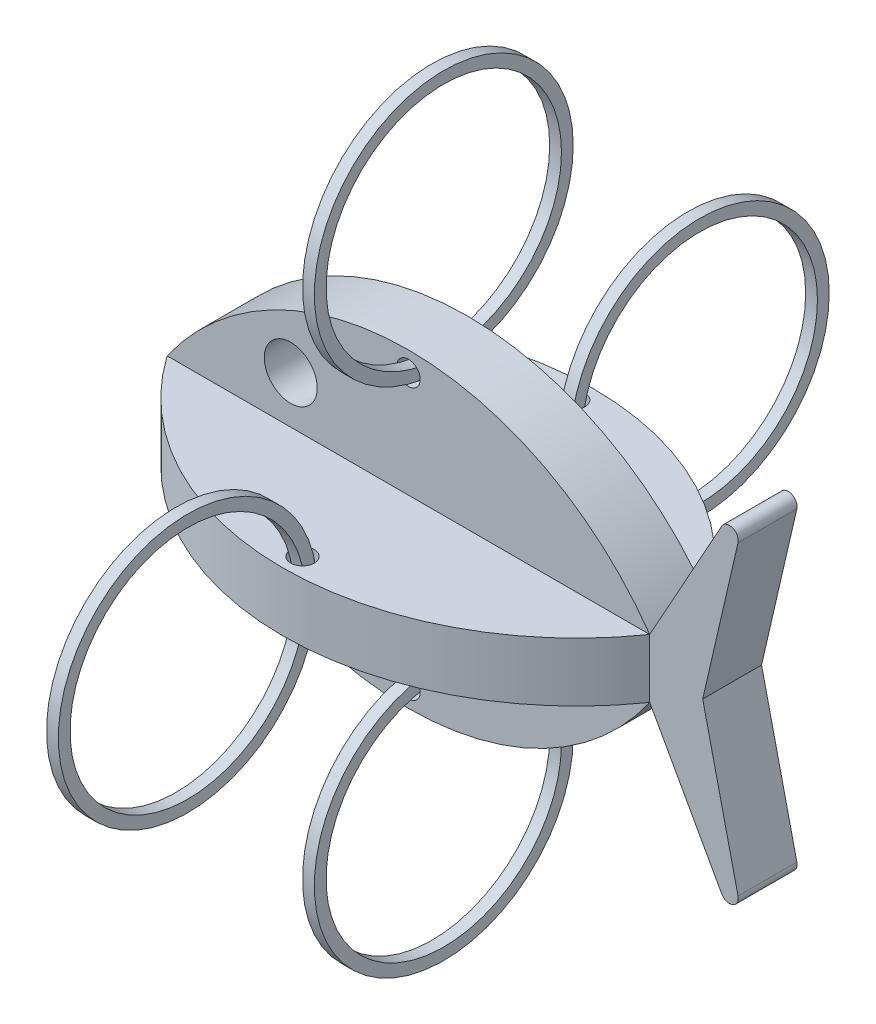
ISO-10303-21;
HEADER;
FILE_DESCRIPTION(('STEP AP214'),'2;1');
FILE_NAME('part.step','',(''),(''),'','','');
FILE_SCHEMA(('AUTOMOTIVE_DESIGN { 1 0 10303 214 1 1 1 1 }'));
ENDSEC;
DATA;
#1=APPLICATION_CONTEXT('core data for automotive mechanical design processes');
#2=APPLICATION_PROTOCOL_DEFINITION('international standard','automotive_design',2000,#1);
#3=PRODUCT_CONTEXT('',#1,'mechanical');
#4=PRODUCT('Part','Part','',(#3));
#5=PRODUCT_RELATED_PRODUCT_CATEGORY('part','',(#4));
#6=PRODUCT_DEFINITION_FORMATION('','',#4);
#7=PRODUCT_DEFINITION_CONTEXT('part definition',#1,'design');
#8=PRODUCT_DEFINITION('design','',#6,#7);
#9=PRODUCT_DEFINITION_SHAPE('','',#8);
#10=(LENGTH_UNIT() NAMED_UNIT(*) SI_UNIT(.MILLI.,.METRE.));
#11=(NAMED_UNIT(*) PLANE_ANGLE_UNIT() SI_UNIT($,.RADIAN.));
#12=(NAMED_UNIT(*) SI_UNIT($,.STERADIAN.) SOLID_ANGLE_UNIT());
#13=UNCERTAINTY_MEASURE_WITH_UNIT(LENGTH_MEASURE(1.E-05),#10,'distance_accuracy_value','');
#14=(GEOMETRIC_REPRESENTATION_CONTEXT(3) GLOBAL_UNCERTAINTY_ASSIGNED_CONTEXT((#13)) GLOBAL_UNIT_ASSIGNED_CONTEXT((#10,
#11,#12)) REPRESENTATION_CONTEXT('',''));
#15=CARTESIAN_POINT('',(0.,0.,0.));
#16=DIRECTION('',(0.,0.,1.));
#17=DIRECTION('',(1.,0.,0.));
#18=AXIS2_PLACEMENT_3D('',#15,#16,#17);
#19=CARTESIAN_POINT('',(41.,0.,23.));
#20=DIRECTION('',(0.,-1.,0.));
#21=DIRECTION('',(0.,0.,-1.));
#22=AXIS2_PLACEMENT_3D('',#19,#20,#21);
#23=CYLINDRICAL_SURFACE('',#22,2.);
#24=CARTESIAN_POINT('',(41.,5.00000000000001,23.));
#25=DIRECTION('',(0.,-1.,0.));
#26=DIRECTION('',(0.,0.,-1.));
#27=AXIS2_PLACEMENT_3D('',#24,#25,#26);
#28=CIRCLE('',#27,2.);
#29=CARTESIAN_POINT('',(41.,5.00000000000001,21.));
#30=VERTEX_POINT('',#29);
#31=EDGE_CURVE('P0_E141',#30,#30,#28,.T.);
#32=ORIENTED_EDGE('',*,*,#31,.F.);
#33=EDGE_LOOP('',(#32));
#34=FACE_BOUND('',#33,.T.);
#35=CARTESIAN_POINT('',(41.,-4.99999999999999,23.));
#36=DIRECTION('',(0.,-1.,0.));
#37=DIRECTION('',(0.,0.,-1.));
#38=AXIS2_PLACEMENT_3D('',#35,#36,#37);
#39=CIRCLE('',#38,2.);
#40=CARTESIAN_POINT('',(41.,-4.99999999999999,21.));
#41=VERTEX_POINT('',#40);
#42=EDGE_CURVE('P0_E20',#41,#41,#39,.T.);
#43=ORIENTED_EDGE('',*,*,#42,.T.);
#44=EDGE_LOOP('',(#43));
#45=FACE_BOUND('',#44,.T.);
#46=ADVANCED_FACE('P0_F17',(#34,#45),#23,.F.);
#47=CARTESIAN_POINT('',(54.3636838274954,-9.95952887576336,5.));
#48=DIRECTION('',(0.,0.,-1.));
#49=DIRECTION('',(0.,1.,0.));
#50=AXIS2_PLACEMENT_3D('',#47,#48,#49);
#51=PLANE('',#50);
#52=CARTESIAN_POINT('',(41.,-23.,5.));
#53=DIRECTION('',(0.,0.,-1.));
#54=DIRECTION('',(0.,1.,0.));
#55=AXIS2_PLACEMENT_3D('',#52,#53,#54);
#56=CIRCLE('',#55,2.);
#57=CARTESIAN_POINT('',(41.,-21.,5.));
#58=VERTEX_POINT('',#57);
#59=EDGE_CURVE('P0_E136',#58,#58,#56,.T.);
#60=ORIENTED_EDGE('',*,*,#59,.T.);
#61=EDGE_LOOP('',(#60));
#62=FACE_BOUND('',#61,.T.);
#63=CARTESIAN_POINT('',(21.,-13.,5.));
#64=DIRECTION('',(0.,0.,-1.));
#65=DIRECTION('',(0.,1.,0.));
#66=AXIS2_PLACEMENT_3D('',#63,#64,#65);
#67=CIRCLE('',#66,4.5);
#68=CARTESIAN_POINT('',(21.,-8.5,5.));
#69=VERTEX_POINT('',#68);
#70=EDGE_CURVE('P0_E139',#69,#69,#67,.T.);
#71=ORIENTED_EDGE('',*,*,#70,.T.);
#72=EDGE_LOOP('',(#71));
#73=FACE_BOUND('',#72,.T.);
#74=CARTESIAN_POINT('',(41.,23.6181760425083,5.));
#75=DIRECTION('',(0.,0.,-1.));
#76=DIRECTION('',(0.,1.,0.));
#77=AXIS2_PLACEMENT_3D('',#74,#75,#76);
#78=CIRCLE('',#77,50.);
#79=CARTESIAN_POINT('',(82.,-5.00000000000005,5.));
#80=VERTEX_POINT('',#79);
#81=CARTESIAN_POINT('',(0.,-5.00000000000004,5.));
#82=VERTEX_POINT('',#81);
#83=EDGE_CURVE('P0_E82',#80,#82,#78,.T.);
#84=ORIENTED_EDGE('',*,*,#83,.F.);
#85=DIRECTION('',(1.,0.,0.));
#86=VECTOR('',#85,1.);
#87=CARTESIAN_POINT('',(54.3636838274954,-5.,5.));
#88=LINE('',#87,#86);
#89=EDGE_CURVE('P0_E85',#80,#82,#88,.F.);
#90=ORIENTED_EDGE('',*,*,#89,.T.);
#91=EDGE_LOOP('',(#84,#90));
#92=FACE_BOUND('',#91,.T.);
#93=ADVANCED_FACE('P0_F84',(#62,#73,#92),#51,.F.);
#94=CARTESIAN_POINT('',(54.3636838274954,-5.,-9.95952887576336));
#95=DIRECTION('',(0.,1.,0.));
#96=DIRECTION('',(0.,0.,1.));
#97=AXIS2_PLACEMENT_3D('',#94,#95,#96);
#98=PLANE('',#97);
#99=ORIENTED_EDGE('',*,*,#42,.F.);
#100=EDGE_LOOP('',(#99));
#101=FACE_BOUND('',#100,.T.);
#102=CARTESIAN_POINT('',(41.,-5.00000000000001,-23.6181760425084));
#103=DIRECTION('',(0.,-1.,0.));
#104=DIRECTION('',(0.,0.,-1.));
#105=AXIS2_PLACEMENT_3D('',#102,#103,#104);
#106=CIRCLE('',#105,50.);
#107=EDGE_CURVE('P0_E90',#82,#80,#106,.F.);
#108=ORIENTED_EDGE('',*,*,#107,.F.);
#109=ORIENTED_EDGE('',*,*,#89,.F.);
#110=EDGE_LOOP('',(#108,#109));
#111=FACE_BOUND('',#110,.T.);
#112=ADVANCED_FACE('P0_F95',(#101,#111),#98,.F.);
#113=CARTESIAN_POINT('',(54.3636838274954,5.,-9.95952887576336));
#114=DIRECTION('',(0.,1.,0.));
#115=DIRECTION('',(0.,0.,1.));
#116=AXIS2_PLACEMENT_3D('',#113,#114,#115);
#117=PLANE('',#116);
#118=ORIENTED_EDGE('',*,*,#31,.T.);
#119=EDGE_LOOP('',(#118));
#120=FACE_BOUND('',#119,.T.);
#121=DIRECTION('',(1.,0.,0.));
#122=VECTOR('',#121,1.);
#123=CARTESIAN_POINT('',(54.3636838274954,4.99999999999997,5.));
#124=LINE('',#123,#122);
#125=CARTESIAN_POINT('',(82.,5.,5.));
#126=VERTEX_POINT('',#125);
#127=CARTESIAN_POINT('',(0.,4.99999999999998,4.99999999999999));
#128=VERTEX_POINT('',#127);
#129=EDGE_CURVE('P0_E91',#126,#128,#124,.F.);
#130=ORIENTED_EDGE('',*,*,#129,.T.);
#131=CARTESIAN_POINT('',(41.,4.99999999999996,-23.6181760425084));
#132=DIRECTION('',(0.,-1.,0.));
#133=DIRECTION('',(0.,0.,-1.));
#134=AXIS2_PLACEMENT_3D('',#131,#132,#133);
#135=CIRCLE('',#134,50.);
#136=EDGE_CURVE('P0_E113',#126,#128,#135,.T.);
#137=ORIENTED_EDGE('',*,*,#136,.F.);
#138=EDGE_LOOP('',(#130,#137));
#139=FACE_BOUND('',#138,.T.);
#140=ADVANCED_FACE('P0_F150',(#120,#139),#117,.T.);
#141=CARTESIAN_POINT('',(54.3636838274954,-9.95952887576336,5.));
#142=DIRECTION('',(0.,0.,-1.));
#143=DIRECTION('',(0.,1.,0.));
#144=AXIS2_PLACEMENT_3D('',#141,#142,#143);
#145=PLANE('',#144);
#146=DIRECTION('',(0.484872195156442,-0.874585018373956,0.));
#147=VECTOR('',#146,1.);
#148=CARTESIAN_POINT('',(94.2265673752612,-27.0535901199555,5.));
#149=LINE('',#148,#147);
#150=CARTESIAN_POINT('',(94.2265673752612,-27.0535901199555,5.));
#151=VERTEX_POINT('',#150);
#152=EDGE_CURVE('P0_E106',#151,#80,#149,.F.);
#153=ORIENTED_EDGE('',*,*,#152,.F.);
#154=CARTESIAN_POINT('',(95.5384449028222,-26.3262818272209,5.));
#155=DIRECTION('',(0.,0.,-1.));
#156=DIRECTION('',(0.,1.,0.));
#157=AXIS2_PLACEMENT_3D('',#154,#155,#156);
#158=CIRCLE('',#157,1.5);
#159=CARTESIAN_POINT('',(97.,-25.9888552457051,5.));
#160=VERTEX_POINT('',#159);
#161=EDGE_CURVE('P0_E126',#160,#151,#158,.T.);
#162=ORIENTED_EDGE('',*,*,#161,.F.);
#163=DIRECTION('',(-0.224951054343865,0.974370064785235,0.));
#164=VECTOR('',#163,1.);
#165=CARTESIAN_POINT('',(91.,0.,5.));
#166=LINE('',#165,#164);
#167=CARTESIAN_POINT('',(91.,0.,5.));
#168=VERTEX_POINT('',#167);
#169=EDGE_CURVE('P0_E390',#168,#160,#166,.F.);
#170=ORIENTED_EDGE('',*,*,#169,.F.);
#171=DIRECTION('',(-0.224951054343866,-0.974370064785235,0.));
#172=VECTOR('',#171,1.);
#173=CARTESIAN_POINT('',(91.,0.,5.));
#174=LINE('',#173,#172);
#175=CARTESIAN_POINT('',(97.,25.988855245705,5.));
#176=VERTEX_POINT('',#175);
#177=EDGE_CURVE('P0_E374',#168,#176,#174,.F.);
#178=ORIENTED_EDGE('',*,*,#177,.T.);
#179=CARTESIAN_POINT('',(95.5384449028222,26.3262818272208,5.));
#180=DIRECTION('',(0.,0.,1.));
#181=DIRECTION('',(0.,-1.,0.));
#182=AXIS2_PLACEMENT_3D('',#179,#180,#181);
#183=CIRCLE('',#182,1.5);
#184=CARTESIAN_POINT('',(94.2265673752612,27.0535901199555,5.));
#185=VERTEX_POINT('',#184);
#186=EDGE_CURVE('P0_E372',#185,#176,#183,.F.);
#187=ORIENTED_EDGE('',*,*,#186,.F.);
#188=DIRECTION('',(0.484872195156442,0.874585018373956,0.));
#189=VECTOR('',#188,1.);
#190=CARTESIAN_POINT('',(94.2265673752612,27.0535901199555,5.));
#191=LINE('',#190,#189);
#192=EDGE_CURVE('P0_E109',#185,#126,#191,.F.);
#193=ORIENTED_EDGE('',*,*,#192,.T.);
#194=DIRECTION('',(0.,-1.,0.));
#195=VECTOR('',#194,1.);
#196=CARTESIAN_POINT('',(82.,0.,4.99999999999999));
#197=LINE('',#196,#195);
#198=EDGE_CURVE('P0_E102',#80,#126,#197,.F.);
#199=ORIENTED_EDGE('',*,*,#198,.F.);
#200=EDGE_LOOP('',(#153,#162,#170,#178,#187,#193,#199));
#201=FACE_BOUND('',#200,.T.);
#202=ADVANCED_FACE('P0_F104',(#201),#145,.F.);
#203=CARTESIAN_POINT('',(21.,-13.,0.));
#204=DIRECTION('',(0.,0.,-1.));
#205=DIRECTION('',(0.,1.,0.));
#206=AXIS2_PLACEMENT_3D('',#203,#204,#205);
#207=CYLINDRICAL_SURFACE('',#206,4.5);
#208=CARTESIAN_POINT('',(21.,-13.,-5.));
#209=DIRECTION('',(0.,0.,-1.));
#210=DIRECTION('',(0.,1.,0.));
#211=AXIS2_PLACEMENT_3D('',#208,#209,#210);
#212=CIRCLE('',#211,4.5);
#213=CARTESIAN_POINT('',(21.,-8.5,-5.));
#214=VERTEX_POINT('',#213);
#215=EDGE_CURVE('P0_E359',#214,#214,#212,.F.);
#216=ORIENTED_EDGE('',*,*,#215,.F.);
#217=EDGE_LOOP('',(#216));
#218=FACE_BOUND('',#217,.T.);
#219=ORIENTED_EDGE('',*,*,#70,.F.);
#220=EDGE_LOOP('',(#219));
#221=FACE_BOUND('',#220,.T.);
#222=ADVANCED_FACE('P0_F239',(#218,#221),#207,.F.);
#223=CARTESIAN_POINT('',(41.,-23.,0.));
#224=DIRECTION('',(0.,0.,-1.));
#225=DIRECTION('',(0.,1.,0.));
#226=AXIS2_PLACEMENT_3D('',#223,#224,#225);
#227=CYLINDRICAL_SURFACE('',#226,2.);
#228=CARTESIAN_POINT('',(41.,-23.,-5.));
#229=DIRECTION('',(0.,0.,-1.));
#230=DIRECTION('',(0.,1.,0.));
#231=AXIS2_PLACEMENT_3D('',#228,#229,#230);
#232=CIRCLE('',#231,2.);
#233=CARTESIAN_POINT('',(41.,-21.,-5.));
#234=VERTEX_POINT('',#233);
#235=EDGE_CURVE('P0_E363',#234,#234,#232,.F.);
#236=ORIENTED_EDGE('',*,*,#235,.F.);
#237=EDGE_LOOP('',(#236));
#238=FACE_BOUND('',#237,.T.);
#239=ORIENTED_EDGE('',*,*,#59,.F.);
#240=EDGE_LOOP('',(#239));
#241=FACE_BOUND('',#240,.T.);
#242=ADVANCED_FACE('P0_F235',(#238,#241),#227,.F.);
#243=CARTESIAN_POINT('',(54.3636838274954,-9.95952887576336,5.));
#244=DIRECTION('',(0.,0.,-1.));
#245=DIRECTION('',(0.,1.,0.));
#246=AXIS2_PLACEMENT_3D('',#243,#244,#245);
#247=PLANE('',#246);
#248=CARTESIAN_POINT('',(41.,23.,5.));
#249=DIRECTION('',(0.,0.,1.));
#250=DIRECTION('',(0.,-1.,0.));
#251=AXIS2_PLACEMENT_3D('',#248,#249,#250);
#252=CIRCLE('',#251,2.);
#253=CARTESIAN_POINT('',(41.,21.,5.));
#254=VERTEX_POINT('',#253);
#255=EDGE_CURVE('P0_E427',#254,#254,#252,.F.);
#256=ORIENTED_EDGE('',*,*,#255,.T.);
#257=EDGE_LOOP('',(#256));
#258=FACE_BOUND('',#257,.T.);
#259=CARTESIAN_POINT('',(21.,13.,5.));
#260=DIRECTION('',(0.,0.,1.));
#261=DIRECTION('',(0.,-1.,0.));
#262=AXIS2_PLACEMENT_3D('',#259,#260,#261);
#263=CIRCLE('',#262,4.5);
#264=CARTESIAN_POINT('',(21.,8.5,5.));
#265=VERTEX_POINT('',#264);
#266=EDGE_CURVE('P0_E430',#265,#265,#263,.F.);
#267=ORIENTED_EDGE('',*,*,#266,.T.);
#268=EDGE_LOOP('',(#267));
#269=FACE_BOUND('',#268,.T.);
#270=CARTESIAN_POINT('',(41.,-23.6181760425084,5.));
#271=DIRECTION('',(0.,0.,1.));
#272=DIRECTION('',(0.,-1.,0.));
#273=AXIS2_PLACEMENT_3D('',#270,#271,#272);
#274=CIRCLE('',#273,50.);
#275=EDGE_CURVE('P0_E366',#128,#126,#274,.F.);
#276=ORIENTED_EDGE('',*,*,#275,.F.);
#277=ORIENTED_EDGE('',*,*,#129,.F.);
#278=EDGE_LOOP('',(#276,#277));
#279=FACE_BOUND('',#278,.T.);
#280=ADVANCED_FACE('P0_F232',(#258,#269,#279),#247,.F.);
#281=CARTESIAN_POINT('',(41.,23.6181760425083,0.));
#282=DIRECTION('',(0.,0.,-1.));
#283=DIRECTION('',(0.,1.,0.));
#284=AXIS2_PLACEMENT_3D('',#281,#282,#283);
#285=CYLINDRICAL_SURFACE('',#284,50.);
#286=DIRECTION('',(0.,0.,1.));
#287=VECTOR('',#286,1.);
#288=CARTESIAN_POINT('',(82.,-5.00000000000003,0.));
#289=LINE('',#288,#287);
#290=CARTESIAN_POINT('',(82.,-5.00000000000006,-5.00000000000005));
#291=VERTEX_POINT('',#290);
#292=EDGE_CURVE('P0_E119',#80,#291,#289,.F.);
#293=ORIENTED_EDGE('',*,*,#292,.F.);
#294=ORIENTED_EDGE('',*,*,#83,.T.);
#295=DIRECTION('',(0.,0.,1.));
#296=VECTOR('',#295,1.);
#297=CARTESIAN_POINT('',(0.,-5.,0.));
#298=LINE('',#297,#296);
#299=CARTESIAN_POINT('',(0.,-5.00000000000001,-5.00000000000004));
#300=VERTEX_POINT('',#299);
#301=EDGE_CURVE('P0_E388',#300,#82,#298,.T.);
#302=ORIENTED_EDGE('',*,*,#301,.F.);
#303=CARTESIAN_POINT('',(41.,23.6181760425083,-5.));
#304=DIRECTION('',(0.,0.,-1.));
#305=DIRECTION('',(0.,1.,0.));
#306=AXIS2_PLACEMENT_3D('',#303,#304,#305);
#307=CIRCLE('',#306,50.);
#308=EDGE_CURVE('P0_E122',#291,#300,#307,.T.);
#309=ORIENTED_EDGE('',*,*,#308,.F.);
#310=EDGE_LOOP('',(#293,#294,#302,#309));
#311=FACE_BOUND('',#310,.T.);
#312=ADVANCED_FACE('P0_F124',(#311),#285,.T.);
#313=CARTESIAN_POINT('',(41.,0.,-23.6181760425084));
#314=DIRECTION('',(0.,-1.,0.));
#315=DIRECTION('',(0.,0.,-1.));
#316=AXIS2_PLACEMENT_3D('',#313,#314,#315);
#317=CYLINDRICAL_SURFACE('',#316,50.);
#318=ORIENTED_EDGE('',*,*,#198,.T.);
#319=ORIENTED_EDGE('',*,*,#136,.T.);
#320=DIRECTION('',(0.,1.,0.));
#321=VECTOR('',#320,1.);
#322=CARTESIAN_POINT('',(0.,-5.,5.));
#323=LINE('',#322,#321);
#324=EDGE_CURVE('P0_E130',#82,#128,#323,.T.);
#325=ORIENTED_EDGE('',*,*,#324,.F.);
#326=ORIENTED_EDGE('',*,*,#107,.T.);
#327=EDGE_LOOP('',(#318,#319,#325,#326));
#328=FACE_BOUND('',#327,.T.);
#329=ADVANCED_FACE('P0_F128',(#328),#317,.T.);
#330=CARTESIAN_POINT('',(94.2265673752612,27.0535901199555,0.));
#331=DIRECTION('',(0.874585018373956,-0.484872195156442,0.));
#332=DIRECTION('',(0.484872195156442,0.874585018373956,0.));
#333=AXIS2_PLACEMENT_3D('',#330,#331,#332);
#334=PLANE('',#333);
#335=ORIENTED_EDGE('',*,*,#192,.F.);
#336=DIRECTION('',(0.,0.,1.));
#337=VECTOR('',#336,1.);
#338=CARTESIAN_POINT('',(94.2265673752613,27.0535901199555,0.));
#339=LINE('',#338,#337);
#340=CARTESIAN_POINT('',(94.2265673752612,27.0535901199555,-5.));
#341=VERTEX_POINT('',#340);
#342=EDGE_CURVE('P0_E375',#341,#185,#339,.T.);
#343=ORIENTED_EDGE('',*,*,#342,.F.);
#344=DIRECTION('',(0.484872195156441,0.874585018373957,0.));
#345=VECTOR('',#344,1.);
#346=CARTESIAN_POINT('',(82.,4.99999999999997,-5.));
#347=LINE('',#346,#345);
#348=CARTESIAN_POINT('',(82.,4.99999999999998,-5.00000000000001));
#349=VERTEX_POINT('',#348);
#350=EDGE_CURVE('P0_E35',#349,#341,#347,.T.);
#351=ORIENTED_EDGE('',*,*,#350,.F.);
#352=DIRECTION('',(0.,0.,1.));
#353=VECTOR('',#352,1.);
#354=CARTESIAN_POINT('',(82.,4.99999999999998,0.));
#355=LINE('',#354,#353);
#356=EDGE_CURVE('P0_E432',#126,#349,#355,.F.);
#357=ORIENTED_EDGE('',*,*,#356,.F.);
#358=EDGE_LOOP('',(#335,#343,#351,#357));
#359=FACE_BOUND('',#358,.T.);
#360=ADVANCED_FACE('P0_F224',(#359),#334,.F.);
#361=CARTESIAN_POINT('',(95.5384449028222,26.3262818272208,0.));
#362=DIRECTION('',(0.,0.,1.));
#363=DIRECTION('',(0.,-1.,0.));
#364=AXIS2_PLACEMENT_3D('',#361,#362,#363);
#365=CYLINDRICAL_SURFACE('',#364,1.5);
#366=DIRECTION('',(0.,0.,1.));
#367=VECTOR('',#366,1.);
#368=CARTESIAN_POINT('',(97.,25.9888552457049,0.));
#369=LINE('',#368,#367);
#370=CARTESIAN_POINT('',(97.,25.988855245705,-5.));
#371=VERTEX_POINT('',#370);
#372=EDGE_CURVE('P0_E378',#176,#371,#369,.F.);
#373=ORIENTED_EDGE('',*,*,#372,.T.);
#374=CARTESIAN_POINT('',(95.5384449028222,26.3262818272208,-5.));
#375=DIRECTION('',(0.,0.,1.));
#376=DIRECTION('',(0.,-1.,0.));
#377=AXIS2_PLACEMENT_3D('',#374,#375,#376);
#378=CIRCLE('',#377,1.5);
#379=EDGE_CURVE('P0_E423',#341,#371,#378,.F.);
#380=ORIENTED_EDGE('',*,*,#379,.F.);
#381=ORIENTED_EDGE('',*,*,#342,.T.);
#382=ORIENTED_EDGE('',*,*,#186,.T.);
#383=EDGE_LOOP('',(#373,#380,#381,#382));
#384=FACE_BOUND('',#383,.T.);
#385=ADVANCED_FACE('P0_F220',(#384),#365,.T.);
#386=CARTESIAN_POINT('',(91.,0.,0.));
#387=DIRECTION('',(-0.974370064785235,0.224951054343866,0.));
#388=DIRECTION('',(-0.224951054343866,-0.974370064785235,0.));
#389=AXIS2_PLACEMENT_3D('',#386,#387,#388);
#390=PLANE('',#389);
#391=ORIENTED_EDGE('',*,*,#177,.F.);
#392=DIRECTION('',(0.,0.,1.));
#393=VECTOR('',#392,1.);
#394=CARTESIAN_POINT('',(91.,0.,0.));
#395=LINE('',#394,#393);
#396=CARTESIAN_POINT('',(91.,0.,-5.));
#397=VERTEX_POINT('',#396);
#398=EDGE_CURVE('P0_E392',#397,#168,#395,.T.);
#399=ORIENTED_EDGE('',*,*,#398,.F.);
#400=DIRECTION('',(-0.224951054343865,-0.974370064785235,0.));
#401=VECTOR('',#400,1.);
#402=CARTESIAN_POINT('',(97.,25.9888552457049,-5.));
#403=LINE('',#402,#401);
#404=EDGE_CURVE('P0_E426',#371,#397,#403,.T.);
#405=ORIENTED_EDGE('',*,*,#404,.F.);
#406=ORIENTED_EDGE('',*,*,#372,.F.);
#407=EDGE_LOOP('',(#391,#399,#405,#406));
#408=FACE_BOUND('',#407,.T.);
#409=ADVANCED_FACE('P0_F216',(#408),#390,.F.);
#410=CARTESIAN_POINT('',(91.,0.,0.));
#411=DIRECTION('',(0.974370064785235,0.224951054343865,0.));
#412=DIRECTION('',(-0.224951054343865,0.974370064785235,0.));
#413=AXIS2_PLACEMENT_3D('',#410,#411,#412);
#414=PLANE('',#413);
#415=ORIENTED_EDGE('',*,*,#398,.T.);
#416=ORIENTED_EDGE('',*,*,#169,.T.);
#417=DIRECTION('',(0.,0.,-1.));
#418=VECTOR('',#417,1.);
#419=CARTESIAN_POINT('',(97.,-25.988855245705,0.));
#420=LINE('',#419,#418);
#421=CARTESIAN_POINT('',(97.,-25.9888552457051,-5.));
#422=VERTEX_POINT('',#421);
#423=EDGE_CURVE('P0_E371',#422,#160,#420,.F.);
#424=ORIENTED_EDGE('',*,*,#423,.F.);
#425=DIRECTION('',(0.224951054343865,-0.974370064785235,0.));
#426=VECTOR('',#425,1.);
#427=CARTESIAN_POINT('',(91.,0.,-5.));
#428=LINE('',#427,#426);
#429=EDGE_CURVE('P0_E422',#397,#422,#428,.T.);
#430=ORIENTED_EDGE('',*,*,#429,.F.);
#431=EDGE_LOOP('',(#415,#416,#424,#430));
#432=FACE_BOUND('',#431,.T.);
#433=ADVANCED_FACE('P0_F212',(#432),#414,.T.);
#434=CARTESIAN_POINT('',(95.5384449028222,-26.3262818272209,0.));
#435=DIRECTION('',(0.,0.,-1.));
#436=DIRECTION('',(0.,1.,0.));
#437=AXIS2_PLACEMENT_3D('',#434,#435,#436);
#438=CYLINDRICAL_SURFACE('',#437,1.5);
#439=ORIENTED_EDGE('',*,*,#423,.T.);
#440=ORIENTED_EDGE('',*,*,#161,.T.);
#441=DIRECTION('',(0.,0.,1.));
#442=VECTOR('',#441,1.);
#443=CARTESIAN_POINT('',(94.2265673752612,-27.0535901199555,0.));
#444=LINE('',#443,#442);
#445=CARTESIAN_POINT('',(94.2265673752612,-27.0535901199555,-5.));
#446=VERTEX_POINT('',#445);
#447=EDGE_CURVE('P0_E121',#446,#151,#444,.T.);
#448=ORIENTED_EDGE('',*,*,#447,.F.);
#449=CARTESIAN_POINT('',(95.5384449028222,-26.3262818272209,-5.));
#450=DIRECTION('',(0.,0.,-1.));
#451=DIRECTION('',(0.,1.,0.));
#452=AXIS2_PLACEMENT_3D('',#449,#450,#451);
#453=CIRCLE('',#452,1.5);
#454=EDGE_CURVE('P0_E418',#422,#446,#453,.T.);
#455=ORIENTED_EDGE('',*,*,#454,.F.);
#456=EDGE_LOOP('',(#439,#440,#448,#455));
#457=FACE_BOUND('',#456,.T.);
#458=ADVANCED_FACE('P0_F209',(#457),#438,.T.);
#459=CARTESIAN_POINT('',(94.2265673752612,-27.0535901199555,0.));
#460=DIRECTION('',(-0.874585018373956,-0.484872195156442,0.));
#461=DIRECTION('',(0.484872195156442,-0.874585018373956,0.));
#462=AXIS2_PLACEMENT_3D('',#459,#460,#461);
#463=PLANE('',#462);
#464=ORIENTED_EDGE('',*,*,#447,.T.);
#465=ORIENTED_EDGE('',*,*,#152,.T.);
#466=ORIENTED_EDGE('',*,*,#292,.T.);
#467=DIRECTION('',(-0.484872195156442,0.874585018373956,0.));
#468=VECTOR('',#467,1.);
#469=CARTESIAN_POINT('',(94.2265673752612,-27.0535901199555,-5.));
#470=LINE('',#469,#468);
#471=EDGE_CURVE('P0_E421',#446,#291,#470,.T.);
#472=ORIENTED_EDGE('',*,*,#471,.F.);
#473=EDGE_LOOP('',(#464,#465,#466,#472));
#474=FACE_BOUND('',#473,.T.);
#475=ADVANCED_FACE('P0_F117',(#474),#463,.T.);
#476=CARTESIAN_POINT('',(54.3636838274954,-9.95952887576336,-5.));
#477=DIRECTION('',(0.,0.,-1.));
#478=DIRECTION('',(0.,1.,0.));
#479=AXIS2_PLACEMENT_3D('',#476,#477,#478);
#480=PLANE('',#479);
#481=ORIENTED_EDGE('',*,*,#235,.T.);
#482=EDGE_LOOP('',(#481));
#483=FACE_BOUND('',#482,.T.);
#484=ORIENTED_EDGE('',*,*,#215,.T.);
#485=EDGE_LOOP('',(#484));
#486=FACE_BOUND('',#485,.T.);
#487=DIRECTION('',(1.,0.,0.));
#488=VECTOR('',#487,1.);
#489=CARTESIAN_POINT('',(54.3636838274954,-5.,-5.));
#490=LINE('',#489,#488);
#491=EDGE_CURVE('P0_E417',#300,#291,#490,.T.);
#492=ORIENTED_EDGE('',*,*,#491,.T.);
#493=ORIENTED_EDGE('',*,*,#308,.T.);
#494=EDGE_LOOP('',(#492,#493));
#495=FACE_BOUND('',#494,.T.);
#496=ADVANCED_FACE('P0_F202',(#483,#486,#495),#480,.T.);
#497=CARTESIAN_POINT('',(41.,-23.6181760425084,0.));
#498=DIRECTION('',(0.,0.,1.));
#499=DIRECTION('',(0.,-1.,0.));
#500=AXIS2_PLACEMENT_3D('',#497,#498,#499);
#501=CYLINDRICAL_SURFACE('',#500,50.);
#502=ORIENTED_EDGE('',*,*,#356,.T.);
#503=CARTESIAN_POINT('',(41.,-23.6181760425084,-5.));
#504=DIRECTION('',(0.,0.,1.));
#505=DIRECTION('',(0.,-1.,0.));
#506=AXIS2_PLACEMENT_3D('',#503,#504,#505);
#507=CIRCLE('',#506,50.);
#508=CARTESIAN_POINT('',(0.,5.,-5.00000000000004));
#509=VERTEX_POINT('',#508);
#510=EDGE_CURVE('P0_E414',#509,#349,#507,.F.);
#511=ORIENTED_EDGE('',*,*,#510,.F.);
#512=DIRECTION('',(0.,0.,1.));
#513=VECTOR('',#512,1.);
#514=CARTESIAN_POINT('',(0.,5.,0.));
#515=LINE('',#514,#513);
#516=EDGE_CURVE('P0_E387',#128,#509,#515,.F.);
#517=ORIENTED_EDGE('',*,*,#516,.F.);
#518=ORIENTED_EDGE('',*,*,#275,.T.);
#519=EDGE_LOOP('',(#502,#511,#517,#518));
#520=FACE_BOUND('',#519,.T.);
#521=ADVANCED_FACE('P0_F198',(#520),#501,.T.);
#522=CARTESIAN_POINT('',(21.,13.,0.));
#523=DIRECTION('',(0.,0.,1.));
#524=DIRECTION('',(0.,-1.,0.));
#525=AXIS2_PLACEMENT_3D('',#522,#523,#524);
#526=CYLINDRICAL_SURFACE('',#525,4.5);
#527=CARTESIAN_POINT('',(21.,13.,-5.));
#528=DIRECTION('',(0.,0.,1.));
#529=DIRECTION('',(0.,-1.,0.));
#530=AXIS2_PLACEMENT_3D('',#527,#528,#529);
#531=CIRCLE('',#530,4.5);
#532=CARTESIAN_POINT('',(21.,8.5,-5.));
#533=VERTEX_POINT('',#532);
#534=EDGE_CURVE('P0_E411',#533,#533,#531,.T.);
#535=ORIENTED_EDGE('',*,*,#534,.F.);
#536=EDGE_LOOP('',(#535));
#537=FACE_BOUND('',#536,.T.);
#538=ORIENTED_EDGE('',*,*,#266,.F.);
#539=EDGE_LOOP('',(#538));
#540=FACE_BOUND('',#539,.T.);
#541=ADVANCED_FACE('P0_F194',(#537,#540),#526,.F.);
#542=CARTESIAN_POINT('',(41.,23.,0.));
#543=DIRECTION('',(0.,0.,1.));
#544=DIRECTION('',(0.,-1.,0.));
#545=AXIS2_PLACEMENT_3D('',#542,#543,#544);
#546=CYLINDRICAL_SURFACE('',#545,2.);
#547=CARTESIAN_POINT('',(41.,23.,-5.));
#548=DIRECTION('',(0.,0.,1.));
#549=DIRECTION('',(0.,-1.,0.));
#550=AXIS2_PLACEMENT_3D('',#547,#548,#549);
#551=CIRCLE('',#550,2.);
#552=CARTESIAN_POINT('',(41.,21.,-5.));
#553=VERTEX_POINT('',#552);
#554=EDGE_CURVE('P0_E407',#553,#553,#551,.T.);
#555=ORIENTED_EDGE('',*,*,#554,.F.);
#556=EDGE_LOOP('',(#555));
#557=FACE_BOUND('',#556,.T.);
#558=ORIENTED_EDGE('',*,*,#255,.F.);
#559=EDGE_LOOP('',(#558));
#560=FACE_BOUND('',#559,.T.);
#561=ADVANCED_FACE('P0_F190',(#557,#560),#546,.F.);
#562=CARTESIAN_POINT('',(0.,-5.,0.));
#563=DIRECTION('',(-1.,0.,0.));
#564=DIRECTION('',(0.,0.,1.));
#565=AXIS2_PLACEMENT_3D('',#562,#563,#564);
#566=PLANE('',#565);
#567=ORIENTED_EDGE('',*,*,#324,.T.);
#568=ORIENTED_EDGE('',*,*,#516,.T.);
#569=DIRECTION('',(0.,1.,0.));
#570=VECTOR('',#569,1.);
#571=CARTESIAN_POINT('',(0.,0.,-5.00000000000005));
#572=LINE('',#571,#570);
#573=EDGE_CURVE('P0_E410',#300,#509,#572,.T.);
#574=ORIENTED_EDGE('',*,*,#573,.F.);
#575=ORIENTED_EDGE('',*,*,#301,.T.);
#576=EDGE_LOOP('',(#567,#568,#574,#575));
#577=FACE_BOUND('',#576,.T.);
#578=ADVANCED_FACE('P0_F186',(#577),#566,.T.);
#579=CARTESIAN_POINT('',(54.3636838274954,-9.95952887576336,-5.));
#580=DIRECTION('',(0.,0.,-1.));
#581=DIRECTION('',(0.,1.,0.));
#582=AXIS2_PLACEMENT_3D('',#579,#580,#581);
#583=PLANE('',#582);
#584=ORIENTED_EDGE('',*,*,#454,.T.);
#585=ORIENTED_EDGE('',*,*,#471,.T.);
#586=DIRECTION('',(0.,1.,0.));
#587=VECTOR('',#586,1.);
#588=CARTESIAN_POINT('',(82.,0.,-5.00000000000002));
#589=LINE('',#588,#587);
#590=EDGE_CURVE('P0_E406',#349,#291,#589,.F.);
#591=ORIENTED_EDGE('',*,*,#590,.F.);
#592=ORIENTED_EDGE('',*,*,#350,.T.);
#593=ORIENTED_EDGE('',*,*,#379,.T.);
#594=ORIENTED_EDGE('',*,*,#404,.T.);
#595=ORIENTED_EDGE('',*,*,#429,.T.);
#596=EDGE_LOOP('',(#584,#585,#591,#592,#593,#594,#595));
#597=FACE_BOUND('',#596,.T.);
#598=ADVANCED_FACE('P0_F182',(#597),#583,.T.);
#599=CARTESIAN_POINT('',(54.3636838274954,-5.,-9.95952887576336));
#600=DIRECTION('',(0.,1.,0.));
#601=DIRECTION('',(0.,0.,1.));
#602=AXIS2_PLACEMENT_3D('',#599,#600,#601);
#603=PLANE('',#602);
#604=CARTESIAN_POINT('',(41.,-5.00000000000001,-23.));
#605=DIRECTION('',(0.,1.,0.));
#606=DIRECTION('',(0.,0.,1.));
#607=AXIS2_PLACEMENT_3D('',#604,#605,#606);
#608=CIRCLE('',#607,2.);
#609=CARTESIAN_POINT('',(41.,-5.00000000000001,-21.));
#610=VERTEX_POINT('',#609);
#611=EDGE_CURVE('P0_E400',#610,#610,#608,.T.);
#612=ORIENTED_EDGE('',*,*,#611,.T.);
#613=EDGE_LOOP('',(#612));
#614=FACE_BOUND('',#613,.T.);
#615=CARTESIAN_POINT('',(41.,-5.00000000000002,23.6181760425083));
#616=DIRECTION('',(0.,1.,0.));
#617=DIRECTION('',(0.,0.,1.));
#618=AXIS2_PLACEMENT_3D('',#615,#616,#617);
#619=CIRCLE('',#618,50.);
#620=EDGE_CURVE('P0_E403',#291,#300,#619,.T.);
#621=ORIENTED_EDGE('',*,*,#620,.F.);
#622=ORIENTED_EDGE('',*,*,#491,.F.);
#623=EDGE_LOOP('',(#621,#622));
#624=FACE_BOUND('',#623,.T.);
#625=ADVANCED_FACE('P0_F178',(#614,#624),#603,.F.);
#626=CARTESIAN_POINT('',(54.3636838274954,-9.95952887576336,-5.));
#627=DIRECTION('',(0.,0.,-1.));
#628=DIRECTION('',(0.,1.,0.));
#629=AXIS2_PLACEMENT_3D('',#626,#627,#628);
#630=PLANE('',#629);
#631=ORIENTED_EDGE('',*,*,#554,.T.);
#632=EDGE_LOOP('',(#631));
#633=FACE_BOUND('',#632,.T.);
#634=ORIENTED_EDGE('',*,*,#534,.T.);
#635=EDGE_LOOP('',(#634));
#636=FACE_BOUND('',#635,.T.);
#637=DIRECTION('',(1.,0.,0.));
#638=VECTOR('',#637,1.);
#639=CARTESIAN_POINT('',(54.3636838274954,5.,-5.));
#640=LINE('',#639,#638);
#641=EDGE_CURVE('P0_E399',#509,#349,#640,.T.);
#642=ORIENTED_EDGE('',*,*,#641,.F.);
#643=ORIENTED_EDGE('',*,*,#510,.T.);
#644=EDGE_LOOP('',(#642,#643));
#645=FACE_BOUND('',#644,.T.);
#646=ADVANCED_FACE('P0_F174',(#633,#636,#645),#630,.T.);
#647=CARTESIAN_POINT('',(41.,0.,23.6181760425083));
#648=DIRECTION('',(0.,1.,0.));
#649=DIRECTION('',(0.,0.,1.));
#650=AXIS2_PLACEMENT_3D('',#647,#648,#649);
#651=CYLINDRICAL_SURFACE('',#650,50.);
#652=ORIENTED_EDGE('',*,*,#590,.T.);
#653=ORIENTED_EDGE('',*,*,#620,.T.);
#654=ORIENTED_EDGE('',*,*,#573,.T.);
#655=CARTESIAN_POINT('',(41.,5.00000000000001,23.6181760425083));
#656=DIRECTION('',(0.,1.,0.));
#657=DIRECTION('',(0.,0.,1.));
#658=AXIS2_PLACEMENT_3D('',#655,#656,#657);
#659=CIRCLE('',#658,50.);
#660=EDGE_CURVE('P0_E26',#349,#509,#659,.T.);
#661=ORIENTED_EDGE('',*,*,#660,.F.);
#662=EDGE_LOOP('',(#652,#653,#654,#661));
#663=FACE_BOUND('',#662,.T.);
#664=ADVANCED_FACE('P0_F167',(#663),#651,.T.);
#665=CARTESIAN_POINT('',(41.,0.,-23.));
#666=DIRECTION('',(0.,1.,0.));
#667=DIRECTION('',(0.,0.,1.));
#668=AXIS2_PLACEMENT_3D('',#665,#666,#667);
#669=CYLINDRICAL_SURFACE('',#668,2.);
#670=CARTESIAN_POINT('',(41.,4.99999999999999,-23.));
#671=DIRECTION('',(0.,1.,0.));
#672=DIRECTION('',(0.,0.,1.));
#673=AXIS2_PLACEMENT_3D('',#670,#671,#672);
#674=CIRCLE('',#673,2.);
#675=CARTESIAN_POINT('',(41.,4.99999999999999,-21.));
#676=VERTEX_POINT('',#675);
#677=EDGE_CURVE('P0_E11',#676,#676,#674,.F.);
#678=ORIENTED_EDGE('',*,*,#677,.F.);
#679=EDGE_LOOP('',(#678));
#680=FACE_BOUND('',#679,.T.);
#681=ORIENTED_EDGE('',*,*,#611,.F.);
#682=EDGE_LOOP('',(#681));
#683=FACE_BOUND('',#682,.T.);
#684=ADVANCED_FACE('P0_F161',(#680,#683),#669,.F.);
#685=CARTESIAN_POINT('',(54.3636838274954,5.,-9.95952887576336));
#686=DIRECTION('',(0.,1.,0.));
#687=DIRECTION('',(0.,0.,1.));
#688=AXIS2_PLACEMENT_3D('',#685,#686,#687);
#689=PLANE('',#688);
#690=ORIENTED_EDGE('',*,*,#677,.T.);
#691=EDGE_LOOP('',(#690));
#692=FACE_BOUND('',#691,.T.);
#693=ORIENTED_EDGE('',*,*,#641,.T.);
#694=ORIENTED_EDGE('',*,*,#660,.T.);
#695=EDGE_LOOP('',(#693,#694));
#696=FACE_BOUND('',#695,.T.);
#697=ADVANCED_FACE('P0_F159',(#692,#696),#689,.T.);
#698=CLOSED_SHELL('',(#46,#93,#112,#140,#202,#222,#242,#280,#312,#329,#360,#385,#409,#433,#458,
#475,#496,#521,#541,#561,#578,#598,#625,#646,#664,#684,#697));
#699=MANIFOLD_SOLID_BREP('P0_B1',#698);
#700=CARTESIAN_POINT('',(41.,-43.5,0.));
#701=DIRECTION('',(1.,0.,0.));
#702=DIRECTION('',(0.,0.,-1.));
#703=AXIS2_PLACEMENT_3D('',#700,#701,#702);
#704=CYLINDRICAL_SURFACE('',#703,20.);
#705=CARTESIAN_POINT('',(42.,-43.5,0.));
#706=DIRECTION('',(1.,0.,0.));
#707=DIRECTION('',(0.,0.,-1.));
#708=AXIS2_PLACEMENT_3D('',#705,#706,#707);
#709=CIRCLE('',#708,20.);
#710=CARTESIAN_POINT('',(42.,-43.5,-20.));
#711=VERTEX_POINT('',#710);
#712=EDGE_CURVE('P1_E18',#711,#711,#709,.F.);
#713=ORIENTED_EDGE('',*,*,#712,.F.);
#714=EDGE_LOOP('',(#713));
#715=FACE_BOUND('',#714,.T.);
#716=CARTESIAN_POINT('',(40.,-43.5,0.));
#717=DIRECTION('',(1.,0.,0.));
#718=DIRECTION('',(0.,0.,-1.));
#719=AXIS2_PLACEMENT_3D('',#716,#717,#718);
#720=CIRCLE('',#719,20.);
#721=CARTESIAN_POINT('',(40.,-43.5,-20.));
#722=VERTEX_POINT('',#721);
#723=EDGE_CURVE('P1_E27',#722,#722,#720,.T.);
#724=ORIENTED_EDGE('',*,*,#723,.F.);
#725=EDGE_LOOP('',(#724));
#726=FACE_BOUND('',#725,.T.);
#727=ADVANCED_FACE('P1_F15',(#715,#726),#704,.F.);
#728=CARTESIAN_POINT('',(42.,-23.5,0.));
#729=DIRECTION('',(1.,0.,0.));
#730=DIRECTION('',(0.,0.,-1.));
#731=AXIS2_PLACEMENT_3D('',#728,#729,#730);
#732=PLANE('',#731);
#733=ORIENTED_EDGE('',*,*,#712,.T.);
#734=EDGE_LOOP('',(#733));
#735=FACE_BOUND('',#734,.T.);
#736=CARTESIAN_POINT('',(42.,-43.5,0.));
#737=DIRECTION('',(1.,0.,0.));
#738=DIRECTION('',(0.,0.,-1.));
#739=AXIS2_PLACEMENT_3D('',#736,#737,#738);
#740=CIRCLE('',#739,22.);
#741=CARTESIAN_POINT('',(42.,-43.5,-22.));
#742=VERTEX_POINT('',#741);
#743=EDGE_CURVE('P1_E22',#742,#742,#740,.F.);
#744=ORIENTED_EDGE('',*,*,#743,.F.);
#745=EDGE_LOOP('',(#744));
#746=FACE_BOUND('',#745,.T.);
#747=ADVANCED_FACE('P1_F35',(#735,#746),#732,.T.);
#748=CARTESIAN_POINT('',(40.,-21.5,0.));
#749=DIRECTION('',(-1.,0.,0.));
#750=DIRECTION('',(0.,0.,1.));
#751=AXIS2_PLACEMENT_3D('',#748,#749,#750);
#752=PLANE('',#751);
#753=ORIENTED_EDGE('',*,*,#723,.T.);
#754=EDGE_LOOP('',(#753));
#755=FACE_BOUND('',#754,.T.);
#756=CARTESIAN_POINT('',(40.,-43.5,0.));
#757=DIRECTION('',(1.,0.,0.));
#758=DIRECTION('',(0.,0.,-1.));
#759=AXIS2_PLACEMENT_3D('',#756,#757,#758);
#760=CIRCLE('',#759,22.);
#761=CARTESIAN_POINT('',(40.,-43.5,-22.));
#762=VERTEX_POINT('',#761);
#763=EDGE_CURVE('P1_E10',#762,#762,#760,.T.);
#764=ORIENTED_EDGE('',*,*,#763,.F.);
#765=EDGE_LOOP('',(#764));
#766=FACE_BOUND('',#765,.T.);
#767=ADVANCED_FACE('P1_F44',(#755,#766),#752,.T.);
#768=CARTESIAN_POINT('',(41.,-43.5,0.));
#769=DIRECTION('',(1.,0.,0.));
#770=DIRECTION('',(0.,0.,-1.));
#771=AXIS2_PLACEMENT_3D('',#768,#769,#770);
#772=CYLINDRICAL_SURFACE('',#771,22.);
#773=ORIENTED_EDGE('',*,*,#763,.T.);
#774=EDGE_LOOP('',(#773));
#775=FACE_BOUND('',#774,.T.);
#776=ORIENTED_EDGE('',*,*,#743,.T.);
#777=EDGE_LOOP('',(#776));
#778=FACE_BOUND('',#777,.T.);
#779=ADVANCED_FACE('P1_F45',(#775,#778),#772,.T.);
#780=CLOSED_SHELL('',(#727,#747,#767,#779));
#781=MANIFOLD_SOLID_BREP('P1_B1',#780);
#782=CARTESIAN_POINT('',(41.,0.,43.5));
#783=DIRECTION('',(1.,0.,0.));
#784=DIRECTION('',(0.,0.,-1.));
#785=AXIS2_PLACEMENT_3D('',#782,#783,#784);
#786=CYLINDRICAL_SURFACE('',#785,20.);
#787=CARTESIAN_POINT('',(42.,0.,43.5));
#788=DIRECTION('',(1.,0.,0.));
#789=DIRECTION('',(0.,0.,-1.));
#790=AXIS2_PLACEMENT_3D('',#787,#788,#789);
#791=CIRCLE('',#790,20.);
#792=CARTESIAN_POINT('',(42.,0.,23.5));
#793=VERTEX_POINT('',#792);
#794=EDGE_CURVE('P2_E18',#793,#793,#791,.F.);
#795=ORIENTED_EDGE('',*,*,#794,.F.);
#796=EDGE_LOOP('',(#795));
#797=FACE_BOUND('',#796,.T.);
#798=CARTESIAN_POINT('',(40.,0.,43.5));
#799=DIRECTION('',(1.,0.,0.));
#800=DIRECTION('',(0.,0.,-1.));
#801=AXIS2_PLACEMENT_3D('',#798,#799,#800);
#802=CIRCLE('',#801,20.);
#803=CARTESIAN_POINT('',(40.,0.,23.5));
#804=VERTEX_POINT('',#803);
#805=EDGE_CURVE('P2_E27',#804,#804,#802,.T.);
#806=ORIENTED_EDGE('',*,*,#805,.F.);
#807=EDGE_LOOP('',(#806));
#808=FACE_BOUND('',#807,.T.);
#809=ADVANCED_FACE('P2_F15',(#797,#808),#786,.F.);
#810=CARTESIAN_POINT('',(42.,0.,23.5));
#811=DIRECTION('',(1.,0.,0.));
#812=DIRECTION('',(0.,0.,-1.));
#813=AXIS2_PLACEMENT_3D('',#810,#811,#812);
#814=PLANE('',#813);
#815=ORIENTED_EDGE('',*,*,#794,.T.);
#816=EDGE_LOOP('',(#815));
#817=FACE_BOUND('',#816,.T.);
#818=CARTESIAN_POINT('',(42.,0.,43.5));
#819=DIRECTION('',(1.,0.,0.));
#820=DIRECTION('',(0.,0.,-1.));
#821=AXIS2_PLACEMENT_3D('',#818,#819,#820);
#822=CIRCLE('',#821,22.);
#823=CARTESIAN_POINT('',(42.,0.,21.5));
#824=VERTEX_POINT('',#823);
#825=EDGE_CURVE('P2_E22',#824,#824,#822,.F.);
#826=ORIENTED_EDGE('',*,*,#825,.F.);
#827=EDGE_LOOP('',(#826));
#828=FACE_BOUND('',#827,.T.);
#829=ADVANCED_FACE('P2_F35',(#817,#828),#814,.T.);
#830=CARTESIAN_POINT('',(40.,0.,21.5));
#831=DIRECTION('',(-1.,0.,0.));
#832=DIRECTION('',(0.,0.,1.));
#833=AXIS2_PLACEMENT_3D('',#830,#831,#832);
#834=PLANE('',#833);
#835=ORIENTED_EDGE('',*,*,#805,.T.);
#836=EDGE_LOOP('',(#835));
#837=FACE_BOUND('',#836,.T.);
#838=CARTESIAN_POINT('',(40.,0.,43.5));
#839=DIRECTION('',(1.,0.,0.));
#840=DIRECTION('',(0.,0.,-1.));
#841=AXIS2_PLACEMENT_3D('',#838,#839,#840);
#842=CIRCLE('',#841,22.);
#843=CARTESIAN_POINT('',(40.,0.,21.5));
#844=VERTEX_POINT('',#843);
#845=EDGE_CURVE('P2_E10',#844,#844,#842,.T.);
#846=ORIENTED_EDGE('',*,*,#845,.F.);
#847=EDGE_LOOP('',(#846));
#848=FACE_BOUND('',#847,.T.);
#849=ADVANCED_FACE('P2_F44',(#837,#848),#834,.T.);
#850=CARTESIAN_POINT('',(41.,0.,43.5));
#851=DIRECTION('',(1.,0.,0.));
#852=DIRECTION('',(0.,0.,-1.));
#853=AXIS2_PLACEMENT_3D('',#850,#851,#852);
#854=CYLINDRICAL_SURFACE('',#853,22.);
#855=ORIENTED_EDGE('',*,*,#845,.T.);
#856=EDGE_LOOP('',(#855));
#857=FACE_BOUND('',#856,.T.);
#858=ORIENTED_EDGE('',*,*,#825,.T.);
#859=EDGE_LOOP('',(#858));
#860=FACE_BOUND('',#859,.T.);
#861=ADVANCED_FACE('P2_F45',(#857,#860),#854,.T.);
#862=CLOSED_SHELL('',(#809,#829,#849,#861));
#863=MANIFOLD_SOLID_BREP('P2_B1',#862);
#864=CARTESIAN_POINT('',(41.,0.,-43.5));
#865=DIRECTION('',(1.,0.,0.));
#866=DIRECTION('',(0.,0.,-1.));
#867=AXIS2_PLACEMENT_3D('',#864,#865,#866);
#868=CYLINDRICAL_SURFACE('',#867,20.);
#869=CARTESIAN_POINT('',(42.,0.,-43.5));
#870=DIRECTION('',(1.,0.,0.));
#871=DIRECTION('',(0.,0.,-1.));
#872=AXIS2_PLACEMENT_3D('',#869,#870,#871);
#873=CIRCLE('',#872,20.);
#874=CARTESIAN_POINT('',(42.,0.,-63.5));
#875=VERTEX_POINT('',#874);
#876=EDGE_CURVE('P3_E18',#875,#875,#873,.F.);
#877=ORIENTED_EDGE('',*,*,#876,.F.);
#878=EDGE_LOOP('',(#877));
#879=FACE_BOUND('',#878,.T.);
#880=CARTESIAN_POINT('',(40.,0.,-43.5));
#881=DIRECTION('',(1.,0.,0.));
#882=DIRECTION('',(0.,0.,-1.));
#883=AXIS2_PLACEMENT_3D('',#880,#881,#882);
#884=CIRCLE('',#883,20.);
#885=CARTESIAN_POINT('',(40.,0.,-63.5));
#886=VERTEX_POINT('',#885);
#887=EDGE_CURVE('P3_E27',#886,#886,#884,.T.);
#888=ORIENTED_EDGE('',*,*,#887,.F.);
#889=EDGE_LOOP('',(#888));
#890=FACE_BOUND('',#889,.T.);
#891=ADVANCED_FACE('P3_F15',(#879,#890),#868,.F.);
#892=CARTESIAN_POINT('',(42.,0.,-23.5));
#893=DIRECTION('',(1.,0.,0.));
#894=DIRECTION('',(0.,0.,-1.));
#895=AXIS2_PLACEMENT_3D('',#892,#893,#894);
#896=PLANE('',#895);
#897=ORIENTED_EDGE('',*,*,#876,.T.);
#898=EDGE_LOOP('',(#897));
#899=FACE_BOUND('',#898,.T.);
#900=CARTESIAN_POINT('',(42.,0.,-43.5));
#901=DIRECTION('',(1.,0.,0.));
#902=DIRECTION('',(0.,0.,-1.));
#903=AXIS2_PLACEMENT_3D('',#900,#901,#902);
#904=CIRCLE('',#903,22.);
#905=CARTESIAN_POINT('',(42.,0.,-65.5));
#906=VERTEX_POINT('',#905);
#907=EDGE_CURVE('P3_E22',#906,#906,#904,.F.);
#908=ORIENTED_EDGE('',*,*,#907,.F.);
#909=EDGE_LOOP('',(#908));
#910=FACE_BOUND('',#909,.T.);
#911=ADVANCED_FACE('P3_F35',(#899,#910),#896,.T.);
#912=CARTESIAN_POINT('',(40.,0.,-21.5));
#913=DIRECTION('',(-1.,0.,0.));
#914=DIRECTION('',(0.,0.,1.));
#915=AXIS2_PLACEMENT_3D('',#912,#913,#914);
#916=PLANE('',#915);
#917=ORIENTED_EDGE('',*,*,#887,.T.);
#918=EDGE_LOOP('',(#917));
#919=FACE_BOUND('',#918,.T.);
#920=CARTESIAN_POINT('',(40.,0.,-43.5));
#921=DIRECTION('',(1.,0.,0.));
#922=DIRECTION('',(0.,0.,-1.));
#923=AXIS2_PLACEMENT_3D('',#920,#921,#922);
#924=CIRCLE('',#923,22.);
#925=CARTESIAN_POINT('',(40.,0.,-65.5));
#926=VERTEX_POINT('',#925);
#927=EDGE_CURVE('P3_E10',#926,#926,#924,.T.);
#928=ORIENTED_EDGE('',*,*,#927,.F.);
#929=EDGE_LOOP('',(#928));
#930=FACE_BOUND('',#929,.T.);
#931=ADVANCED_FACE('P3_F44',(#919,#930),#916,.T.);
#932=CARTESIAN_POINT('',(41.,0.,-43.5));
#933=DIRECTION('',(1.,0.,0.));
#934=DIRECTION('',(0.,0.,-1.));
#935=AXIS2_PLACEMENT_3D('',#932,#933,#934);
#936=CYLINDRICAL_SURFACE('',#935,22.);
#937=ORIENTED_EDGE('',*,*,#927,.T.);
#938=EDGE_LOOP('',(#937));
#939=FACE_BOUND('',#938,.T.);
#940=ORIENTED_EDGE('',*,*,#907,.T.);
#941=EDGE_LOOP('',(#940));
#942=FACE_BOUND('',#941,.T.);
#943=ADVANCED_FACE('P3_F45',(#939,#942),#936,.T.);
#944=CLOSED_SHELL('',(#891,#911,#931,#943));
#945=MANIFOLD_SOLID_BREP('P3_B1',#944);
#946=CARTESIAN_POINT('',(41.,43.5,0.));
#947=DIRECTION('',(1.,0.,0.));
#948=DIRECTION('',(0.,0.,-1.));
#949=AXIS2_PLACEMENT_3D('',#946,#947,#948);
#950=CYLINDRICAL_SURFACE('',#949,20.);
#951=CARTESIAN_POINT('',(42.,43.5,0.));
#952=DIRECTION('',(1.,0.,0.));
#953=DIRECTION('',(0.,0.,-1.));
#954=AXIS2_PLACEMENT_3D('',#951,#952,#953);
#955=CIRCLE('',#954,20.);
#956=CARTESIAN_POINT('',(42.,43.5,-20.));
#957=VERTEX_POINT('',#956);
#958=EDGE_CURVE('P4_E18',#957,#957,#955,.F.);
#959=ORIENTED_EDGE('',*,*,#958,.F.);
#960=EDGE_LOOP('',(#959));
#961=FACE_BOUND('',#960,.T.);
#962=CARTESIAN_POINT('',(40.,43.5,0.));
#963=DIRECTION('',(1.,0.,0.));
#964=DIRECTION('',(0.,0.,-1.));
#965=AXIS2_PLACEMENT_3D('',#962,#963,#964);
#966=CIRCLE('',#965,20.);
#967=CARTESIAN_POINT('',(40.,43.5,-20.));
#968=VERTEX_POINT('',#967);
#969=EDGE_CURVE('P4_E27',#968,#968,#966,.T.);
#970=ORIENTED_EDGE('',*,*,#969,.F.);
#971=EDGE_LOOP('',(#970));
#972=FACE_BOUND('',#971,.T.);
#973=ADVANCED_FACE('P4_F15',(#961,#972),#950,.F.);
#974=CARTESIAN_POINT('',(42.,23.5,0.));
#975=DIRECTION('',(1.,0.,0.));
#976=DIRECTION('',(0.,0.,-1.));
#977=AXIS2_PLACEMENT_3D('',#974,#975,#976);
#978=PLANE('',#977);
#979=ORIENTED_EDGE('',*,*,#958,.T.);
#980=EDGE_LOOP('',(#979));
#981=FACE_BOUND('',#980,.T.);
#982=CARTESIAN_POINT('',(42.,43.5,0.));
#983=DIRECTION('',(1.,0.,0.));
#984=DIRECTION('',(0.,0.,-1.));
#985=AXIS2_PLACEMENT_3D('',#982,#983,#984);
#986=CIRCLE('',#985,22.);
#987=CARTESIAN_POINT('',(42.,43.5,-22.));
#988=VERTEX_POINT('',#987);
#989=EDGE_CURVE('P4_E22',#988,#988,#986,.F.);
#990=ORIENTED_EDGE('',*,*,#989,.F.);
#991=EDGE_LOOP('',(#990));
#992=FACE_BOUND('',#991,.T.);
#993=ADVANCED_FACE('P4_F35',(#981,#992),#978,.T.);
#994=CARTESIAN_POINT('',(40.,21.5,0.));
#995=DIRECTION('',(-1.,0.,0.));
#996=DIRECTION('',(0.,0.,1.));
#997=AXIS2_PLACEMENT_3D('',#994,#995,#996);
#998=PLANE('',#997);
#999=ORIENTED_EDGE('',*,*,#969,.T.);
#1000=EDGE_LOOP('',(#999));
#1001=FACE_BOUND('',#1000,.T.);
#1002=CARTESIAN_POINT('',(40.,43.5,0.));
#1003=DIRECTION('',(1.,0.,0.));
#1004=DIRECTION('',(0.,0.,-1.));
#1005=AXIS2_PLACEMENT_3D('',#1002,#1003,#1004);
#1006=CIRCLE('',#1005,22.);
#1007=CARTESIAN_POINT('',(40.,43.5,-22.));
#1008=VERTEX_POINT('',#1007);
#1009=EDGE_CURVE('P4_E10',#1008,#1008,#1006,.T.);
#1010=ORIENTED_EDGE('',*,*,#1009,.F.);
#1011=EDGE_LOOP('',(#1010));
#1012=FACE_BOUND('',#1011,.T.);
#1013=ADVANCED_FACE('P4_F44',(#1001,#1012),#998,.T.);
#1014=CARTESIAN_POINT('',(41.,43.5,0.));
#1015=DIRECTION('',(1.,0.,0.));
#1016=DIRECTION('',(0.,0.,-1.));
#1017=AXIS2_PLACEMENT_3D('',#1014,#1015,#1016);
#1018=CYLINDRICAL_SURFACE('',#1017,22.);
#1019=ORIENTED_EDGE('',*,*,#1009,.T.);
#1020=EDGE_LOOP('',(#1019));
#1021=FACE_BOUND('',#1020,.T.);
#1022=ORIENTED_EDGE('',*,*,#989,.T.);
#1023=EDGE_LOOP('',(#1022));
#1024=FACE_BOUND('',#1023,.T.);
#1025=ADVANCED_FACE('P4_F45',(#1021,#1024),#1018,.T.);
#1026=CLOSED_SHELL('',(#973,#993,#1013,#1025));
#1027=MANIFOLD_SOLID_BREP('P4_B1',#1026);
#1028=ADVANCED_BREP_SHAPE_REPRESENTATION('',(#18,#699,#781,#863,#945,#1027),#14);
#1029=SHAPE_DEFINITION_REPRESENTATION(#9,#1028);
ENDSEC;
END-ISO-10303-21;
